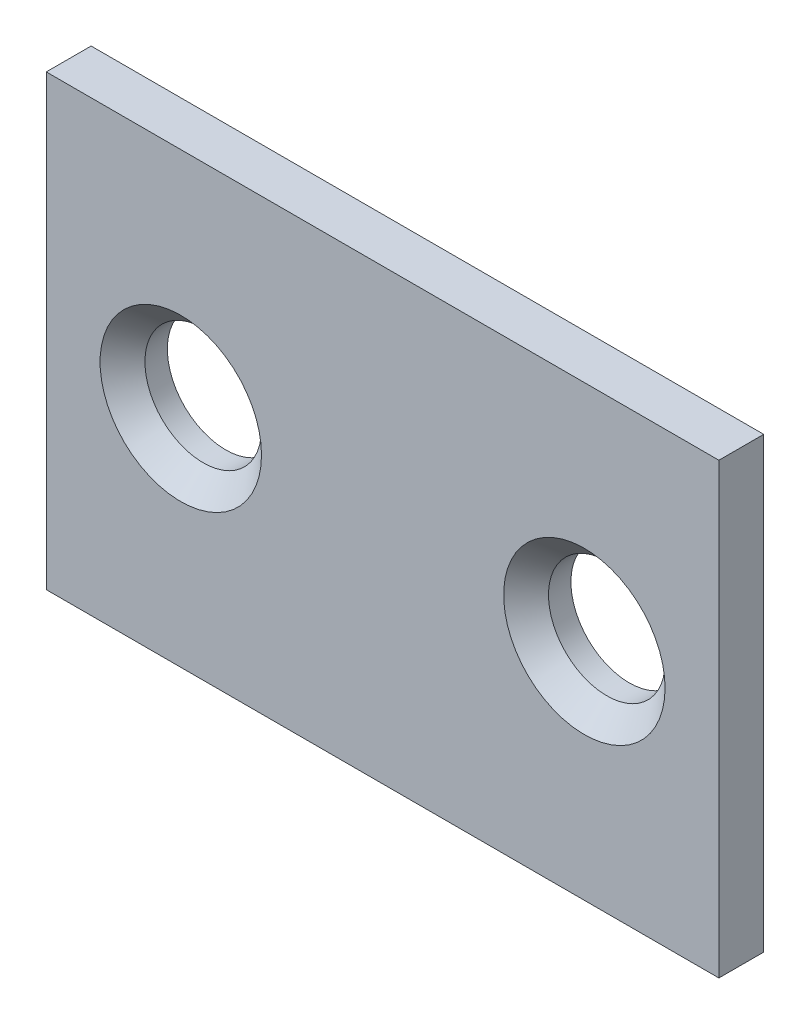
ISO-10303-21;
HEADER;
FILE_DESCRIPTION(('STEP AP214'),'2;1');
FILE_NAME('part.step','',(''),(''),'','','');
FILE_SCHEMA(('AUTOMOTIVE_DESIGN { 1 0 10303 214 1 1 1 1 }'));
ENDSEC;
DATA;
#1=APPLICATION_CONTEXT('core data for automotive mechanical design processes');
#2=APPLICATION_PROTOCOL_DEFINITION('international standard','automotive_design',2000,#1);
#3=PRODUCT_CONTEXT('',#1,'mechanical');
#4=PRODUCT('Part','Part','',(#3));
#5=PRODUCT_RELATED_PRODUCT_CATEGORY('part','',(#4));
#6=PRODUCT_DEFINITION_FORMATION('','',#4);
#7=PRODUCT_DEFINITION_CONTEXT('part definition',#1,'design');
#8=PRODUCT_DEFINITION('design','',#6,#7);
#9=PRODUCT_DEFINITION_SHAPE('','',#8);
#10=(LENGTH_UNIT() NAMED_UNIT(*) SI_UNIT(.MILLI.,.METRE.));
#11=(NAMED_UNIT(*) PLANE_ANGLE_UNIT() SI_UNIT($,.RADIAN.));
#12=(NAMED_UNIT(*) SI_UNIT($,.STERADIAN.) SOLID_ANGLE_UNIT());
#13=UNCERTAINTY_MEASURE_WITH_UNIT(LENGTH_MEASURE(1.E-05),#10,'distance_accuracy_value','');
#14=(GEOMETRIC_REPRESENTATION_CONTEXT(3) GLOBAL_UNCERTAINTY_ASSIGNED_CONTEXT((#13)) GLOBAL_UNIT_ASSIGNED_CONTEXT((#10,
#11,#12)) REPRESENTATION_CONTEXT('',''));
#15=CARTESIAN_POINT('',(0.,0.,0.));
#16=DIRECTION('',(0.,0.,1.));
#17=DIRECTION('',(1.,0.,0.));
#18=AXIS2_PLACEMENT_3D('',#15,#16,#17);
#19=CARTESIAN_POINT('',(15.,-10.,2.));
#20=DIRECTION('',(-1.,0.,0.));
#21=DIRECTION('',(0.,0.,1.));
#22=AXIS2_PLACEMENT_3D('',#19,#20,#21);
#23=PLANE('',#22);
#24=DIRECTION('',(0.,1.,0.));
#25=VECTOR('',#24,1.);
#26=CARTESIAN_POINT('',(15.,-10.,0.));
#27=LINE('',#26,#25);
#28=CARTESIAN_POINT('',(15.,-10.,0.));
#29=VERTEX_POINT('',#28);
#30=CARTESIAN_POINT('',(15.,10.,0.));
#31=VERTEX_POINT('',#30);
#32=EDGE_CURVE('E99',#29,#31,#27,.T.);
#33=ORIENTED_EDGE('',*,*,#32,.T.);
#34=DIRECTION('',(0.,0.,-1.));
#35=VECTOR('',#34,1.);
#36=CARTESIAN_POINT('',(15.,10.,2.));
#37=LINE('',#36,#35);
#38=CARTESIAN_POINT('',(15.,10.,2.));
#39=VERTEX_POINT('',#38);
#40=EDGE_CURVE('E11',#39,#31,#37,.T.);
#41=ORIENTED_EDGE('',*,*,#40,.F.);
#42=DIRECTION('',(0.,1.,0.));
#43=VECTOR('',#42,1.);
#44=CARTESIAN_POINT('',(15.,-10.,2.));
#45=LINE('',#44,#43);
#46=CARTESIAN_POINT('',(15.,-10.,2.));
#47=VERTEX_POINT('',#46);
#48=EDGE_CURVE('E87',#47,#39,#45,.T.);
#49=ORIENTED_EDGE('',*,*,#48,.F.);
#50=DIRECTION('',(0.,0.,-1.));
#51=VECTOR('',#50,1.);
#52=CARTESIAN_POINT('',(15.,-10.,2.));
#53=LINE('',#52,#51);
#54=EDGE_CURVE('E95',#47,#29,#53,.T.);
#55=ORIENTED_EDGE('',*,*,#54,.T.);
#56=EDGE_LOOP('',(#33,#41,#49,#55));
#57=FACE_BOUND('',#56,.T.);
#58=ADVANCED_FACE('F36',(#57),#23,.F.);
#59=CARTESIAN_POINT('',(-15.,10.,2.));
#60=DIRECTION('',(0.,-1.,0.));
#61=DIRECTION('',(0.,0.,-1.));
#62=AXIS2_PLACEMENT_3D('',#59,#60,#61);
#63=PLANE('',#62);
#64=DIRECTION('',(-1.,0.,0.));
#65=VECTOR('',#64,1.);
#66=CARTESIAN_POINT('',(-15.,10.,0.));
#67=LINE('',#66,#65);
#68=CARTESIAN_POINT('',(-15.,10.,0.));
#69=VERTEX_POINT('',#68);
#70=EDGE_CURVE('E91',#31,#69,#67,.T.);
#71=ORIENTED_EDGE('',*,*,#70,.T.);
#72=DIRECTION('',(0.,0.,-1.));
#73=VECTOR('',#72,1.);
#74=CARTESIAN_POINT('',(-15.,10.,2.));
#75=LINE('',#74,#73);
#76=CARTESIAN_POINT('',(-15.,10.,2.));
#77=VERTEX_POINT('',#76);
#78=EDGE_CURVE('E44',#77,#69,#75,.T.);
#79=ORIENTED_EDGE('',*,*,#78,.F.);
#80=DIRECTION('',(-1.,0.,0.));
#81=VECTOR('',#80,1.);
#82=CARTESIAN_POINT('',(-15.,10.,2.));
#83=LINE('',#82,#81);
#84=EDGE_CURVE('E82',#39,#77,#83,.T.);
#85=ORIENTED_EDGE('',*,*,#84,.F.);
#86=ORIENTED_EDGE('',*,*,#40,.T.);
#87=EDGE_LOOP('',(#71,#79,#85,#86));
#88=FACE_BOUND('',#87,.T.);
#89=ADVANCED_FACE('F90',(#88),#63,.F.);
#90=CARTESIAN_POINT('',(-15.,-10.,2.));
#91=DIRECTION('',(1.,0.,0.));
#92=DIRECTION('',(0.,0.,-1.));
#93=AXIS2_PLACEMENT_3D('',#90,#91,#92);
#94=PLANE('',#93);
#95=DIRECTION('',(0.,-1.,0.));
#96=VECTOR('',#95,1.);
#97=CARTESIAN_POINT('',(-15.,-10.,0.));
#98=LINE('',#97,#96);
#99=CARTESIAN_POINT('',(-15.,-10.,0.));
#100=VERTEX_POINT('',#99);
#101=EDGE_CURVE('E69',#69,#100,#98,.T.);
#102=ORIENTED_EDGE('',*,*,#101,.T.);
#103=DIRECTION('',(0.,0.,-1.));
#104=VECTOR('',#103,1.);
#105=CARTESIAN_POINT('',(-15.,-10.,2.));
#106=LINE('',#105,#104);
#107=CARTESIAN_POINT('',(-15.,-10.,2.));
#108=VERTEX_POINT('',#107);
#109=EDGE_CURVE('E92',#108,#100,#106,.T.);
#110=ORIENTED_EDGE('',*,*,#109,.F.);
#111=DIRECTION('',(0.,-1.,0.));
#112=VECTOR('',#111,1.);
#113=CARTESIAN_POINT('',(-15.,-10.,2.));
#114=LINE('',#113,#112);
#115=EDGE_CURVE('E85',#77,#108,#114,.T.);
#116=ORIENTED_EDGE('',*,*,#115,.F.);
#117=ORIENTED_EDGE('',*,*,#78,.T.);
#118=EDGE_LOOP('',(#102,#110,#116,#117));
#119=FACE_BOUND('',#118,.T.);
#120=ADVANCED_FACE('F93',(#119),#94,.F.);
#121=CARTESIAN_POINT('',(-15.,-10.,2.));
#122=DIRECTION('',(0.,1.,0.));
#123=DIRECTION('',(0.,0.,1.));
#124=AXIS2_PLACEMENT_3D('',#121,#122,#123);
#125=PLANE('',#124);
#126=DIRECTION('',(1.,0.,0.));
#127=VECTOR('',#126,1.);
#128=CARTESIAN_POINT('',(-15.,-10.,0.));
#129=LINE('',#128,#127);
#130=EDGE_CURVE('E75',#100,#29,#129,.T.);
#131=ORIENTED_EDGE('',*,*,#130,.T.);
#132=ORIENTED_EDGE('',*,*,#54,.F.);
#133=DIRECTION('',(1.,0.,0.));
#134=VECTOR('',#133,1.);
#135=CARTESIAN_POINT('',(-15.,-10.,2.));
#136=LINE('',#135,#134);
#137=EDGE_CURVE('E52',#108,#47,#136,.T.);
#138=ORIENTED_EDGE('',*,*,#137,.F.);
#139=ORIENTED_EDGE('',*,*,#109,.T.);
#140=EDGE_LOOP('',(#131,#132,#138,#139));
#141=FACE_BOUND('',#140,.T.);
#142=ADVANCED_FACE('F107',(#141),#125,.F.);
#143=CARTESIAN_POINT('',(0.,0.,2.));
#144=DIRECTION('',(0.,0.,-1.));
#145=DIRECTION('',(-1.,0.,0.));
#146=AXIS2_PLACEMENT_3D('',#143,#144,#145);
#147=PLANE('',#146);
#148=CARTESIAN_POINT('',(9.,0.,2.));
#149=DIRECTION('',(0.,0.,1.));
#150=DIRECTION('',(1.,0.,0.));
#151=AXIS2_PLACEMENT_3D('',#148,#149,#150);
#152=CIRCLE('',#151,3.6);
#153=CARTESIAN_POINT('',(12.6,0.,2.));
#154=VERTEX_POINT('',#153);
#155=EDGE_CURVE('E127',#154,#154,#152,.T.);
#156=ORIENTED_EDGE('',*,*,#155,.F.);
#157=EDGE_LOOP('',(#156));
#158=FACE_BOUND('',#157,.T.);
#159=CARTESIAN_POINT('',(-9.,0.,2.));
#160=DIRECTION('',(0.,0.,1.));
#161=DIRECTION('',(1.,0.,0.));
#162=AXIS2_PLACEMENT_3D('',#159,#160,#161);
#163=CIRCLE('',#162,3.6);
#164=CARTESIAN_POINT('',(-5.4,0.,2.));
#165=VERTEX_POINT('',#164);
#166=EDGE_CURVE('E118',#165,#165,#163,.T.);
#167=ORIENTED_EDGE('',*,*,#166,.F.);
#168=EDGE_LOOP('',(#167));
#169=FACE_BOUND('',#168,.T.);
#170=ORIENTED_EDGE('',*,*,#48,.T.);
#171=ORIENTED_EDGE('',*,*,#84,.T.);
#172=ORIENTED_EDGE('',*,*,#115,.T.);
#173=ORIENTED_EDGE('',*,*,#137,.T.);
#174=EDGE_LOOP('',(#170,#171,#172,#173));
#175=FACE_BOUND('',#174,.T.);
#176=ADVANCED_FACE('F83',(#158,#169,#175),#147,.F.);
#177=CARTESIAN_POINT('',(0.,0.,0.));
#178=DIRECTION('',(0.,0.,-1.));
#179=DIRECTION('',(-1.,0.,0.));
#180=AXIS2_PLACEMENT_3D('',#177,#178,#179);
#181=PLANE('',#180);
#182=CARTESIAN_POINT('',(9.,0.,0.));
#183=DIRECTION('',(0.,0.,1.));
#184=DIRECTION('',(1.,0.,0.));
#185=AXIS2_PLACEMENT_3D('',#182,#183,#184);
#186=CIRCLE('',#185,2.6);
#187=CARTESIAN_POINT('',(11.6,0.,0.));
#188=VERTEX_POINT('',#187);
#189=EDGE_CURVE('E121',#188,#188,#186,.T.);
#190=ORIENTED_EDGE('',*,*,#189,.T.);
#191=EDGE_LOOP('',(#190));
#192=FACE_BOUND('',#191,.T.);
#193=CARTESIAN_POINT('',(-9.,0.,0.));
#194=DIRECTION('',(0.,0.,1.));
#195=DIRECTION('',(1.,0.,0.));
#196=AXIS2_PLACEMENT_3D('',#193,#194,#195);
#197=CIRCLE('',#196,2.6);
#198=CARTESIAN_POINT('',(-6.4,0.,0.));
#199=VERTEX_POINT('',#198);
#200=EDGE_CURVE('E102',#199,#199,#197,.T.);
#201=ORIENTED_EDGE('',*,*,#200,.T.);
#202=EDGE_LOOP('',(#201));
#203=FACE_BOUND('',#202,.T.);
#204=ORIENTED_EDGE('',*,*,#32,.F.);
#205=ORIENTED_EDGE('',*,*,#130,.F.);
#206=ORIENTED_EDGE('',*,*,#101,.F.);
#207=ORIENTED_EDGE('',*,*,#70,.F.);
#208=EDGE_LOOP('',(#204,#205,#206,#207));
#209=FACE_BOUND('',#208,.T.);
#210=ADVANCED_FACE('F110',(#192,#203,#209),#181,.T.);
#211=CARTESIAN_POINT('',(-9.,0.,2.));
#212=DIRECTION('',(0.,0.,1.));
#213=DIRECTION('',(1.,0.,0.));
#214=AXIS2_PLACEMENT_3D('',#211,#212,#213);
#215=CYLINDRICAL_SURFACE('',#214,2.6);
#216=ORIENTED_EDGE('',*,*,#200,.F.);
#217=EDGE_LOOP('',(#216));
#218=FACE_BOUND('',#217,.T.);
#219=CARTESIAN_POINT('',(-9.,0.,0.999999999999999));
#220=DIRECTION('',(0.,0.,1.));
#221=DIRECTION('',(1.,0.,0.));
#222=AXIS2_PLACEMENT_3D('',#219,#220,#221);
#223=CIRCLE('',#222,2.6);
#224=CARTESIAN_POINT('',(-6.4,0.,0.999999999999999));
#225=VERTEX_POINT('',#224);
#226=EDGE_CURVE('E115',#225,#225,#223,.T.);
#227=ORIENTED_EDGE('',*,*,#226,.T.);
#228=EDGE_LOOP('',(#227));
#229=FACE_BOUND('',#228,.T.);
#230=ADVANCED_FACE('F141',(#218,#229),#215,.F.);
#231=CARTESIAN_POINT('',(-9.,0.,2.));
#232=DIRECTION('',(0.,0.,1.));
#233=DIRECTION('',(1.,0.,0.));
#234=AXIS2_PLACEMENT_3D('',#231,#232,#233);
#235=CONICAL_SURFACE('',#234,3.6,0.785398163397447);
#236=ORIENTED_EDGE('',*,*,#226,.F.);
#237=EDGE_LOOP('',(#236));
#238=FACE_BOUND('',#237,.T.);
#239=ORIENTED_EDGE('',*,*,#166,.T.);
#240=EDGE_LOOP('',(#239));
#241=FACE_BOUND('',#240,.T.);
#242=ADVANCED_FACE('F138',(#238,#241),#235,.F.);
#243=CARTESIAN_POINT('',(9.,0.,2.));
#244=DIRECTION('',(0.,0.,1.));
#245=DIRECTION('',(1.,0.,0.));
#246=AXIS2_PLACEMENT_3D('',#243,#244,#245);
#247=CYLINDRICAL_SURFACE('',#246,2.6);
#248=ORIENTED_EDGE('',*,*,#189,.F.);
#249=EDGE_LOOP('',(#248));
#250=FACE_BOUND('',#249,.T.);
#251=CARTESIAN_POINT('',(9.,0.,0.999999999999999));
#252=DIRECTION('',(0.,0.,1.));
#253=DIRECTION('',(1.,0.,0.));
#254=AXIS2_PLACEMENT_3D('',#251,#252,#253);
#255=CIRCLE('',#254,2.6);
#256=CARTESIAN_POINT('',(11.6,0.,0.999999999999999));
#257=VERTEX_POINT('',#256);
#258=EDGE_CURVE('E124',#257,#257,#255,.T.);
#259=ORIENTED_EDGE('',*,*,#258,.T.);
#260=EDGE_LOOP('',(#259));
#261=FACE_BOUND('',#260,.T.);
#262=ADVANCED_FACE('F140',(#250,#261),#247,.F.);
#263=CARTESIAN_POINT('',(9.,0.,2.));
#264=DIRECTION('',(0.,0.,1.));
#265=DIRECTION('',(1.,0.,0.));
#266=AXIS2_PLACEMENT_3D('',#263,#264,#265);
#267=CONICAL_SURFACE('',#266,3.6,0.785398163397447);
#268=ORIENTED_EDGE('',*,*,#258,.F.);
#269=EDGE_LOOP('',(#268));
#270=FACE_BOUND('',#269,.T.);
#271=ORIENTED_EDGE('',*,*,#155,.T.);
#272=EDGE_LOOP('',(#271));
#273=FACE_BOUND('',#272,.T.);
#274=ADVANCED_FACE('F131',(#270,#273),#267,.F.);
#275=CLOSED_SHELL('',(#58,#89,#120,#142,#176,#210,#230,#242,#262,#274));
#276=MANIFOLD_SOLID_BREP('B2',#275);
#277=ADVANCED_BREP_SHAPE_REPRESENTATION('',(#18,#276),#14);
#278=SHAPE_DEFINITION_REPRESENTATION(#9,#277);
ENDSEC;
END-ISO-10303-21;
